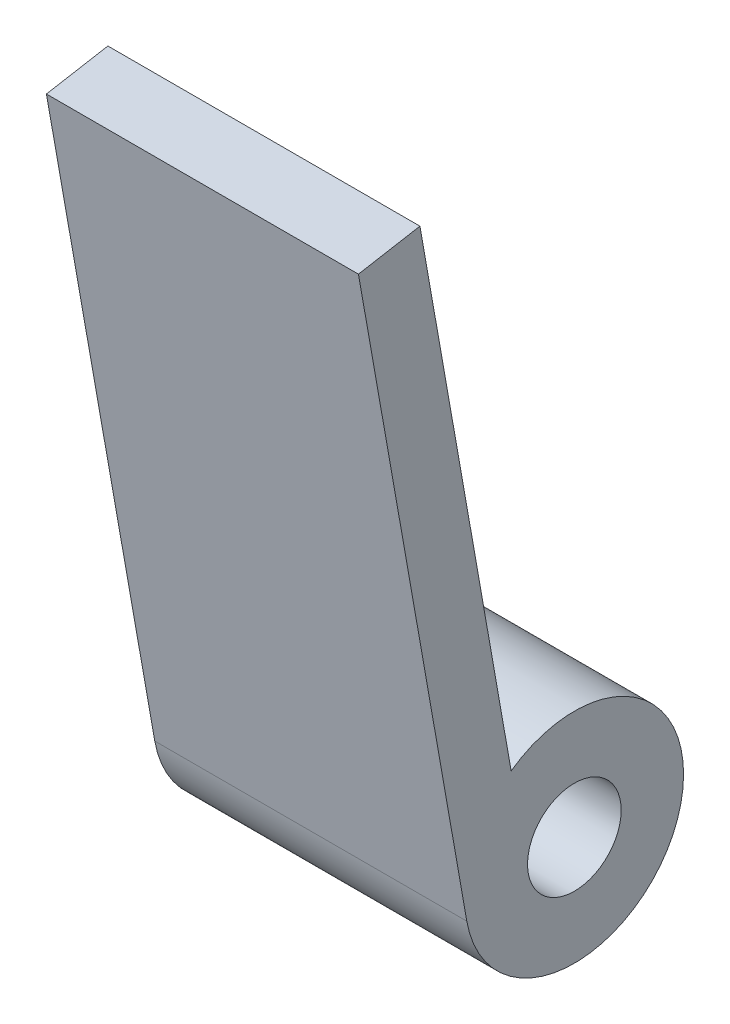
ISO-10303-21;
HEADER;
FILE_DESCRIPTION(('STEP AP214'),'2;1');
FILE_NAME('part.step','',(''),(''),'','','');
FILE_SCHEMA(('AUTOMOTIVE_DESIGN { 1 0 10303 214 1 1 1 1 }'));
ENDSEC;
DATA;
#1=APPLICATION_CONTEXT('core data for automotive mechanical design processes');
#2=APPLICATION_PROTOCOL_DEFINITION('international standard','automotive_design',2000,#1);
#3=PRODUCT_CONTEXT('',#1,'mechanical');
#4=PRODUCT('Part','Part','',(#3));
#5=PRODUCT_RELATED_PRODUCT_CATEGORY('part','',(#4));
#6=PRODUCT_DEFINITION_FORMATION('','',#4);
#7=PRODUCT_DEFINITION_CONTEXT('part definition',#1,'design');
#8=PRODUCT_DEFINITION('design','',#6,#7);
#9=PRODUCT_DEFINITION_SHAPE('','',#8);
#10=(LENGTH_UNIT() NAMED_UNIT(*) SI_UNIT(.MILLI.,.METRE.));
#11=(NAMED_UNIT(*) PLANE_ANGLE_UNIT() SI_UNIT($,.RADIAN.));
#12=(NAMED_UNIT(*) SI_UNIT($,.STERADIAN.) SOLID_ANGLE_UNIT());
#13=UNCERTAINTY_MEASURE_WITH_UNIT(LENGTH_MEASURE(1.E-05),#10,'distance_accuracy_value','');
#14=(GEOMETRIC_REPRESENTATION_CONTEXT(3) GLOBAL_UNCERTAINTY_ASSIGNED_CONTEXT((#13)) GLOBAL_UNIT_ASSIGNED_CONTEXT((#10,
#11,#12)) REPRESENTATION_CONTEXT('',''));
#15=CARTESIAN_POINT('',(0.,0.,0.));
#16=DIRECTION('',(0.,0.,1.));
#17=DIRECTION('',(1.,0.,0.));
#18=AXIS2_PLACEMENT_3D('',#15,#16,#17);
#19=CARTESIAN_POINT('',(661.894917120642,88.4299373021792,-292.982817719454));
#20=DIRECTION('',(0.,0.173648177666934,-0.984807753012207));
#21=DIRECTION('',(0.,0.984807753012207,0.173648177666934));
#22=AXIS2_PLACEMENT_3D('',#19,#20,#21);
#23=PLANE('',#22);
#24=DIRECTION('',(1.,0.,0.));
#25=VECTOR('',#24,1.);
#26=CARTESIAN_POINT('',(661.894917120642,105.011856805512,-290.05897791908));
#27=LINE('',#26,#25);
#28=CARTESIAN_POINT('',(666.894917120642,105.011856805512,-290.05897791908));
#29=VERTEX_POINT('',#28);
#30=CARTESIAN_POINT('',(656.894917120642,105.011856805512,-290.05897791908));
#31=VERTEX_POINT('',#30);
#32=EDGE_CURVE('E95',#29,#31,#27,.F.);
#33=ORIENTED_EDGE('',*,*,#32,.F.);
#34=DIRECTION('',(0.,-0.984807753012203,-0.173648177666959));
#35=VECTOR('',#34,1.);
#36=CARTESIAN_POINT('',(666.894917120642,105.011856805512,-290.05897791908));
#37=LINE('',#36,#35);
#38=CARTESIAN_POINT('',(666.894917120642,88.4299373021795,-292.982817719454));
#39=VERTEX_POINT('',#38);
#40=EDGE_CURVE('E66',#29,#39,#37,.T.);
#41=ORIENTED_EDGE('',*,*,#40,.T.);
#42=DIRECTION('',(1.,0.,0.));
#43=VECTOR('',#42,1.);
#44=CARTESIAN_POINT('',(661.894917120642,88.4299373021795,-292.982817719454));
#45=LINE('',#44,#43);
#46=CARTESIAN_POINT('',(656.894917120642,88.4299373021795,-292.982817719454));
#47=VERTEX_POINT('',#46);
#48=EDGE_CURVE('E61',#47,#39,#45,.T.);
#49=ORIENTED_EDGE('',*,*,#48,.F.);
#50=DIRECTION('',(0.,-0.984807753012203,-0.173648177666959));
#51=VECTOR('',#50,1.);
#52=CARTESIAN_POINT('',(656.894917120642,105.011856805512,-290.05897791908));
#53=LINE('',#52,#51);
#54=EDGE_CURVE('E88',#31,#47,#53,.T.);
#55=ORIENTED_EDGE('',*,*,#54,.F.);
#56=EDGE_LOOP('',(#33,#41,#49,#55));
#57=FACE_BOUND('',#56,.T.);
#58=ADVANCED_FACE('F17',(#57),#23,.T.);
#59=CARTESIAN_POINT('',(661.894917120642,85.5761740117687,-295.009153101937));
#60=DIRECTION('',(1.,0.,0.));
#61=DIRECTION('',(0.,0.,-1.));
#62=AXIS2_PLACEMENT_3D('',#59,#60,#61);
#63=CYLINDRICAL_SURFACE('',#62,1.5);
#64=CARTESIAN_POINT('',(666.894917120642,85.5761740117687,-295.009153101937));
#65=DIRECTION('',(1.,0.,0.));
#66=DIRECTION('',(0.,0.,-1.));
#67=AXIS2_PLACEMENT_3D('',#64,#65,#66);
#68=CIRCLE('',#67,1.5);
#69=CARTESIAN_POINT('',(666.894917120642,85.5761740117687,-296.509153101937));
#70=VERTEX_POINT('',#69);
#71=EDGE_CURVE('E65',#70,#70,#68,.T.);
#72=ORIENTED_EDGE('',*,*,#71,.T.);
#73=EDGE_LOOP('',(#72));
#74=FACE_BOUND('',#73,.T.);
#75=CARTESIAN_POINT('',(656.894917120642,85.5761740117687,-295.009153101937));
#76=DIRECTION('',(1.,0.,0.));
#77=DIRECTION('',(0.,0.,-1.));
#78=AXIS2_PLACEMENT_3D('',#75,#76,#77);
#79=CIRCLE('',#78,1.5);
#80=CARTESIAN_POINT('',(656.894917120642,85.5761740117687,-296.509153101937));
#81=VERTEX_POINT('',#80);
#82=EDGE_CURVE('E76',#81,#81,#79,.T.);
#83=ORIENTED_EDGE('',*,*,#82,.F.);
#84=EDGE_LOOP('',(#83));
#85=FACE_BOUND('',#84,.T.);
#86=ADVANCED_FACE('F110',(#74,#85),#63,.F.);
#87=CARTESIAN_POINT('',(661.894917120642,85.5761740117687,-295.009153101937));
#88=DIRECTION('',(1.,0.,0.));
#89=DIRECTION('',(0.,0.,-1.));
#90=AXIS2_PLACEMENT_3D('',#87,#88,#89);
#91=CYLINDRICAL_SURFACE('',#90,3.49999999999989);
#92=DIRECTION('',(1.,0.,0.));
#93=VECTOR('',#92,1.);
#94=CARTESIAN_POINT('',(661.894917120642,84.9684053899344,-291.562325966394));
#95=LINE('',#94,#93);
#96=CARTESIAN_POINT('',(656.894917120642,84.9684053899344,-291.562325966394));
#97=VERTEX_POINT('',#96);
#98=CARTESIAN_POINT('',(666.894917120642,84.9684053899344,-291.562325966394));
#99=VERTEX_POINT('',#98);
#100=EDGE_CURVE('E58',#97,#99,#95,.T.);
#101=ORIENTED_EDGE('',*,*,#100,.F.);
#102=CARTESIAN_POINT('',(656.894917120642,85.5761740117687,-295.009153101937));
#103=DIRECTION('',(1.,0.,0.));
#104=DIRECTION('',(0.,0.,-1.));
#105=AXIS2_PLACEMENT_3D('',#102,#103,#104);
#106=CIRCLE('',#105,3.49999999999989);
#107=EDGE_CURVE('E79',#47,#97,#106,.F.);
#108=ORIENTED_EDGE('',*,*,#107,.F.);
#109=ORIENTED_EDGE('',*,*,#48,.T.);
#110=CARTESIAN_POINT('',(666.894917120642,85.5761740117687,-295.009153101937));
#111=DIRECTION('',(1.,0.,0.));
#112=DIRECTION('',(0.,0.,-1.));
#113=AXIS2_PLACEMENT_3D('',#110,#111,#112);
#114=CIRCLE('',#113,3.49999999999989);
#115=EDGE_CURVE('E20',#39,#99,#114,.F.);
#116=ORIENTED_EDGE('',*,*,#115,.T.);
#117=EDGE_LOOP('',(#101,#108,#109,#116));
#118=FACE_BOUND('',#117,.T.);
#119=ADVANCED_FACE('F56',(#118),#91,.T.);
#120=CARTESIAN_POINT('',(666.894917120642,43.1757528863374,-362.871701067118));
#121=DIRECTION('',(-1.,0.,0.));
#122=DIRECTION('',(0.,0.,1.));
#123=AXIS2_PLACEMENT_3D('',#120,#121,#122);
#124=PLANE('',#123);
#125=ORIENTED_EDGE('',*,*,#71,.F.);
#126=EDGE_LOOP('',(#125));
#127=FACE_BOUND('',#126,.T.);
#128=ORIENTED_EDGE('',*,*,#115,.F.);
#129=ORIENTED_EDGE('',*,*,#40,.F.);
#130=DIRECTION('',(0.,-0.173648177666933,0.984807753012208));
#131=VECTOR('',#130,1.);
#132=CARTESIAN_POINT('',(666.894917120642,105.011856805512,-290.05897791908));
#133=LINE('',#132,#131);
#134=CARTESIAN_POINT('',(666.894917120642,104.664560450179,-288.089362413055));
#135=VERTEX_POINT('',#134);
#136=EDGE_CURVE('E71',#135,#29,#133,.F.);
#137=ORIENTED_EDGE('',*,*,#136,.F.);
#138=DIRECTION('',(0.,-0.984807753012207,-0.173648177666937));
#139=VECTOR('',#138,1.);
#140=CARTESIAN_POINT('',(666.894917120642,84.9684053899344,-291.562325966394));
#141=LINE('',#140,#139);
#142=EDGE_CURVE('E68',#99,#135,#141,.F.);
#143=ORIENTED_EDGE('',*,*,#142,.F.);
#144=EDGE_LOOP('',(#128,#129,#137,#143));
#145=FACE_BOUND('',#144,.T.);
#146=ADVANCED_FACE('F69',(#127,#145),#124,.F.);
#147=CARTESIAN_POINT('',(661.894917120642,105.011856805512,-290.05897791908));
#148=DIRECTION('',(0.,0.984807753012208,0.173648177666933));
#149=DIRECTION('',(0.,-0.173648177666933,0.984807753012208));
#150=AXIS2_PLACEMENT_3D('',#147,#148,#149);
#151=PLANE('',#150);
#152=DIRECTION('',(1.,0.,0.));
#153=VECTOR('',#152,1.);
#154=CARTESIAN_POINT('',(661.894917120642,104.664560450179,-288.089362413055));
#155=LINE('',#154,#153);
#156=CARTESIAN_POINT('',(656.894917120642,104.664560450179,-288.089362413055));
#157=VERTEX_POINT('',#156);
#158=EDGE_CURVE('E26',#135,#157,#155,.F.);
#159=ORIENTED_EDGE('',*,*,#158,.F.);
#160=ORIENTED_EDGE('',*,*,#136,.T.);
#161=ORIENTED_EDGE('',*,*,#32,.T.);
#162=DIRECTION('',(0.,0.17364817766655,-0.984807753012275));
#163=VECTOR('',#162,1.);
#164=CARTESIAN_POINT('',(656.894917120642,104.664560450179,-288.089362413056));
#165=LINE('',#164,#163);
#166=EDGE_CURVE('E35',#157,#31,#165,.T.);
#167=ORIENTED_EDGE('',*,*,#166,.F.);
#168=EDGE_LOOP('',(#159,#160,#161,#167));
#169=FACE_BOUND('',#168,.T.);
#170=ADVANCED_FACE('F114',(#169),#151,.T.);
#171=CARTESIAN_POINT('',(656.894917120642,43.1757528863374,-362.871701067118));
#172=DIRECTION('',(-1.,0.,0.));
#173=DIRECTION('',(0.,0.,1.));
#174=AXIS2_PLACEMENT_3D('',#171,#172,#173);
#175=PLANE('',#174);
#176=ORIENTED_EDGE('',*,*,#82,.T.);
#177=EDGE_LOOP('',(#176));
#178=FACE_BOUND('',#177,.T.);
#179=ORIENTED_EDGE('',*,*,#107,.T.);
#180=DIRECTION('',(0.,-0.984807753012207,-0.173648177666937));
#181=VECTOR('',#180,1.);
#182=CARTESIAN_POINT('',(656.894917120642,84.9684053899344,-291.562325966394));
#183=LINE('',#182,#181);
#184=EDGE_CURVE('E11',#157,#97,#183,.T.);
#185=ORIENTED_EDGE('',*,*,#184,.F.);
#186=ORIENTED_EDGE('',*,*,#166,.T.);
#187=ORIENTED_EDGE('',*,*,#54,.T.);
#188=EDGE_LOOP('',(#179,#185,#186,#187));
#189=FACE_BOUND('',#188,.T.);
#190=ADVANCED_FACE('F121',(#178,#189),#175,.T.);
#191=CARTESIAN_POINT('',(661.894917120642,84.9684053899344,-291.562325966394));
#192=DIRECTION('',(0.,-0.173648177666937,0.984807753012207));
#193=DIRECTION('',(0.,-0.984807753012207,-0.173648177666937));
#194=AXIS2_PLACEMENT_3D('',#191,#192,#193);
#195=PLANE('',#194);
#196=ORIENTED_EDGE('',*,*,#158,.T.);
#197=ORIENTED_EDGE('',*,*,#184,.T.);
#198=ORIENTED_EDGE('',*,*,#100,.T.);
#199=ORIENTED_EDGE('',*,*,#142,.T.);
#200=EDGE_LOOP('',(#196,#197,#198,#199));
#201=FACE_BOUND('',#200,.T.);
#202=ADVANCED_FACE('F75',(#201),#195,.T.);
#203=CLOSED_SHELL('',(#58,#86,#119,#146,#170,#190,#202));
#204=MANIFOLD_SOLID_BREP('B1',#203);
#205=ADVANCED_BREP_SHAPE_REPRESENTATION('',(#18,#204),#14);
#206=SHAPE_DEFINITION_REPRESENTATION(#9,#205);
ENDSEC;
END-ISO-10303-21;
